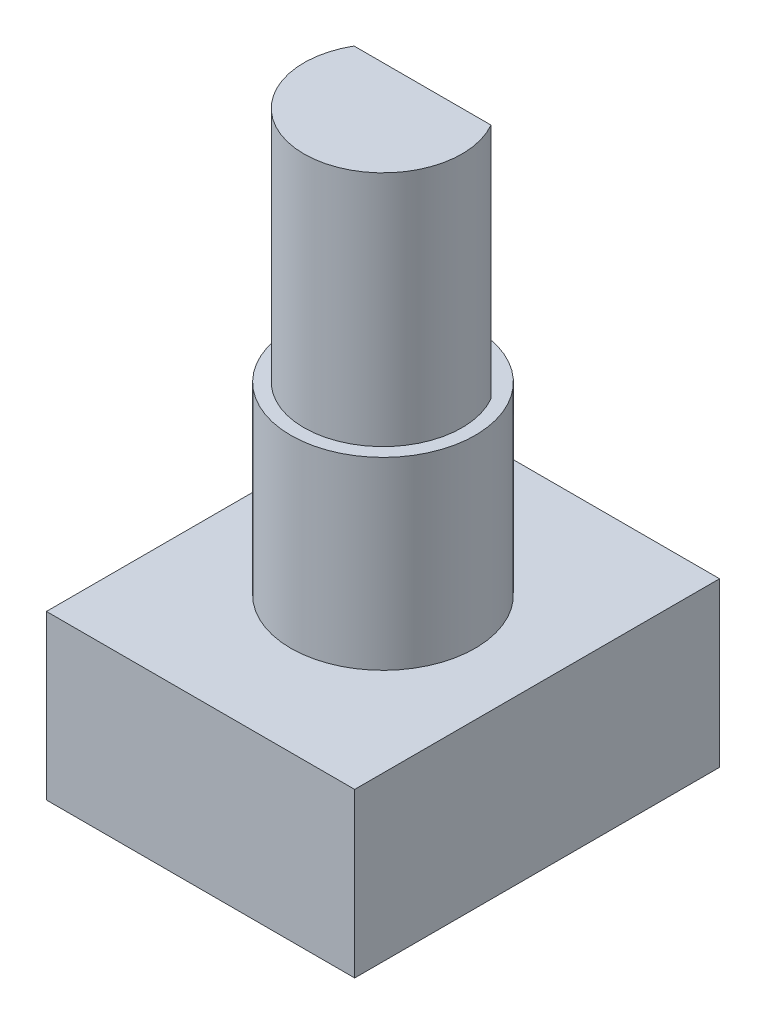
ISO-10303-21;
HEADER;
FILE_DESCRIPTION(('STEP AP214'),'2;1');
FILE_NAME('part.step','',(''),(''),'','','');
FILE_SCHEMA(('AUTOMOTIVE_DESIGN { 1 0 10303 214 1 1 1 1 }'));
ENDSEC;
DATA;
#1=APPLICATION_CONTEXT('core data for automotive mechanical design processes');
#2=APPLICATION_PROTOCOL_DEFINITION('international standard','automotive_design',2000,#1);
#3=PRODUCT_CONTEXT('',#1,'mechanical');
#4=PRODUCT('Part','Part','',(#3));
#5=PRODUCT_RELATED_PRODUCT_CATEGORY('part','',(#4));
#6=PRODUCT_DEFINITION_FORMATION('','',#4);
#7=PRODUCT_DEFINITION_CONTEXT('part definition',#1,'design');
#8=PRODUCT_DEFINITION('design','',#6,#7);
#9=PRODUCT_DEFINITION_SHAPE('','',#8);
#10=(LENGTH_UNIT() NAMED_UNIT(*) SI_UNIT(.MILLI.,.METRE.));
#11=(NAMED_UNIT(*) PLANE_ANGLE_UNIT() SI_UNIT($,.RADIAN.));
#12=(NAMED_UNIT(*) SI_UNIT($,.STERADIAN.) SOLID_ANGLE_UNIT());
#13=UNCERTAINTY_MEASURE_WITH_UNIT(LENGTH_MEASURE(1.E-05),#10,'distance_accuracy_value','');
#14=(GEOMETRIC_REPRESENTATION_CONTEXT(3) GLOBAL_UNCERTAINTY_ASSIGNED_CONTEXT((#13)) GLOBAL_UNIT_ASSIGNED_CONTEXT((#10,
#11,#12)) REPRESENTATION_CONTEXT('',''));
#15=CARTESIAN_POINT('',(0.,0.,0.));
#16=DIRECTION('',(0.,0.,1.));
#17=DIRECTION('',(1.,0.,0.));
#18=AXIS2_PLACEMENT_3D('',#15,#16,#17);
#19=CARTESIAN_POINT('',(0.,6.2,0.));
#20=DIRECTION('',(1.,0.,0.));
#21=DIRECTION('',(0.,0.,-1.));
#22=AXIS2_PLACEMENT_3D('',#19,#20,#21);
#23=PLANE('',#22);
#24=DIRECTION('',(0.,0.,1.));
#25=VECTOR('',#24,1.);
#26=CARTESIAN_POINT('',(0.,0.,0.));
#27=LINE('',#26,#25);
#28=CARTESIAN_POINT('',(0.,0.,-13.85));
#29=VERTEX_POINT('',#28);
#30=CARTESIAN_POINT('',(0.,0.,0.));
#31=VERTEX_POINT('',#30);
#32=EDGE_CURVE('E131',#29,#31,#27,.T.);
#33=ORIENTED_EDGE('',*,*,#32,.T.);
#34=DIRECTION('',(0.,-1.,0.));
#35=VECTOR('',#34,1.);
#36=CARTESIAN_POINT('',(0.,6.2,0.));
#37=LINE('',#36,#35);
#38=CARTESIAN_POINT('',(0.,6.2,0.));
#39=VERTEX_POINT('',#38);
#40=EDGE_CURVE('E46',#39,#31,#37,.T.);
#41=ORIENTED_EDGE('',*,*,#40,.F.);
#42=DIRECTION('',(0.,0.,1.));
#43=VECTOR('',#42,1.);
#44=CARTESIAN_POINT('',(0.,6.2,0.));
#45=LINE('',#44,#43);
#46=CARTESIAN_POINT('',(0.,6.2,-13.85));
#47=VERTEX_POINT('',#46);
#48=EDGE_CURVE('E136',#47,#39,#45,.T.);
#49=ORIENTED_EDGE('',*,*,#48,.F.);
#50=DIRECTION('',(0.,-1.,0.));
#51=VECTOR('',#50,1.);
#52=CARTESIAN_POINT('',(0.,6.2,-13.85));
#53=LINE('',#52,#51);
#54=EDGE_CURVE('E146',#47,#29,#53,.T.);
#55=ORIENTED_EDGE('',*,*,#54,.T.);
#56=EDGE_LOOP('',(#33,#41,#49,#55));
#57=FACE_BOUND('',#56,.T.);
#58=ADVANCED_FACE('F43',(#57),#23,.F.);
#59=CARTESIAN_POINT('',(0.,6.2,0.));
#60=DIRECTION('',(0.,0.,-1.));
#61=DIRECTION('',(-1.,0.,0.));
#62=AXIS2_PLACEMENT_3D('',#59,#60,#61);
#63=PLANE('',#62);
#64=DIRECTION('',(1.,0.,0.));
#65=VECTOR('',#64,1.);
#66=CARTESIAN_POINT('',(0.,0.,0.));
#67=LINE('',#66,#65);
#68=CARTESIAN_POINT('',(11.7,0.,0.));
#69=VERTEX_POINT('',#68);
#70=EDGE_CURVE('E150',#31,#69,#67,.T.);
#71=ORIENTED_EDGE('',*,*,#70,.T.);
#72=DIRECTION('',(0.,-1.,0.));
#73=VECTOR('',#72,1.);
#74=CARTESIAN_POINT('',(11.7,6.2,0.));
#75=LINE('',#74,#73);
#76=CARTESIAN_POINT('',(11.7,6.2,0.));
#77=VERTEX_POINT('',#76);
#78=EDGE_CURVE('E162',#77,#69,#75,.T.);
#79=ORIENTED_EDGE('',*,*,#78,.F.);
#80=DIRECTION('',(1.,0.,0.));
#81=VECTOR('',#80,1.);
#82=CARTESIAN_POINT('',(0.,6.2,0.));
#83=LINE('',#82,#81);
#84=EDGE_CURVE('E96',#39,#77,#83,.T.);
#85=ORIENTED_EDGE('',*,*,#84,.F.);
#86=ORIENTED_EDGE('',*,*,#40,.T.);
#87=EDGE_LOOP('',(#71,#79,#85,#86));
#88=FACE_BOUND('',#87,.T.);
#89=ADVANCED_FACE('F170',(#88),#63,.F.);
#90=CARTESIAN_POINT('',(11.7,6.2,0.));
#91=DIRECTION('',(-1.,0.,0.));
#92=DIRECTION('',(0.,0.,1.));
#93=AXIS2_PLACEMENT_3D('',#90,#91,#92);
#94=PLANE('',#93);
#95=DIRECTION('',(0.,0.,-1.));
#96=VECTOR('',#95,1.);
#97=CARTESIAN_POINT('',(11.7,0.,0.));
#98=LINE('',#97,#96);
#99=CARTESIAN_POINT('',(11.7,0.,-13.85));
#100=VERTEX_POINT('',#99);
#101=EDGE_CURVE('E153',#69,#100,#98,.T.);
#102=ORIENTED_EDGE('',*,*,#101,.T.);
#103=DIRECTION('',(0.,-1.,0.));
#104=VECTOR('',#103,1.);
#105=CARTESIAN_POINT('',(11.7,6.2,-13.85));
#106=LINE('',#105,#104);
#107=CARTESIAN_POINT('',(11.7,6.2,-13.85));
#108=VERTEX_POINT('',#107);
#109=EDGE_CURVE('E160',#108,#100,#106,.T.);
#110=ORIENTED_EDGE('',*,*,#109,.F.);
#111=DIRECTION('',(0.,0.,-1.));
#112=VECTOR('',#111,1.);
#113=CARTESIAN_POINT('',(11.7,6.2,0.));
#114=LINE('',#113,#112);
#115=EDGE_CURVE('E141',#77,#108,#114,.T.);
#116=ORIENTED_EDGE('',*,*,#115,.F.);
#117=ORIENTED_EDGE('',*,*,#78,.T.);
#118=EDGE_LOOP('',(#102,#110,#116,#117));
#119=FACE_BOUND('',#118,.T.);
#120=ADVANCED_FACE('F177',(#119),#94,.F.);
#121=CARTESIAN_POINT('',(0.,6.2,-13.85));
#122=DIRECTION('',(0.,0.,1.));
#123=DIRECTION('',(1.,0.,0.));
#124=AXIS2_PLACEMENT_3D('',#121,#122,#123);
#125=PLANE('',#124);
#126=DIRECTION('',(-1.,0.,0.));
#127=VECTOR('',#126,1.);
#128=CARTESIAN_POINT('',(0.,0.,-13.85));
#129=LINE('',#128,#127);
#130=EDGE_CURVE('E88',#100,#29,#129,.T.);
#131=ORIENTED_EDGE('',*,*,#130,.T.);
#132=ORIENTED_EDGE('',*,*,#54,.F.);
#133=DIRECTION('',(-1.,0.,0.));
#134=VECTOR('',#133,1.);
#135=CARTESIAN_POINT('',(0.,6.2,-13.85));
#136=LINE('',#135,#134);
#137=EDGE_CURVE('E67',#108,#47,#136,.T.);
#138=ORIENTED_EDGE('',*,*,#137,.F.);
#139=ORIENTED_EDGE('',*,*,#109,.T.);
#140=EDGE_LOOP('',(#131,#132,#138,#139));
#141=FACE_BOUND('',#140,.T.);
#142=ADVANCED_FACE('F178',(#141),#125,.F.);
#143=CARTESIAN_POINT('',(0.,6.2,0.));
#144=DIRECTION('',(0.,-1.,0.));
#145=DIRECTION('',(0.,0.,-1.));
#146=AXIS2_PLACEMENT_3D('',#143,#144,#145);
#147=PLANE('',#146);
#148=CARTESIAN_POINT('',(5.85,6.2,-6.925));
#149=DIRECTION('',(0.,1.,0.));
#150=DIRECTION('',(0.,0.,1.));
#151=AXIS2_PLACEMENT_3D('',#148,#149,#150);
#152=CIRCLE('',#151,3.5);
#153=CARTESIAN_POINT('',(5.85,6.2,-3.425));
#154=VERTEX_POINT('',#153);
#155=EDGE_CURVE('E11',#154,#154,#152,.T.);
#156=ORIENTED_EDGE('',*,*,#155,.F.);
#157=EDGE_LOOP('',(#156));
#158=FACE_BOUND('',#157,.T.);
#159=ORIENTED_EDGE('',*,*,#48,.T.);
#160=ORIENTED_EDGE('',*,*,#84,.T.);
#161=ORIENTED_EDGE('',*,*,#115,.T.);
#162=ORIENTED_EDGE('',*,*,#137,.T.);
#163=EDGE_LOOP('',(#159,#160,#161,#162));
#164=FACE_BOUND('',#163,.T.);
#165=ADVANCED_FACE('F179',(#158,#164),#147,.F.);
#166=CARTESIAN_POINT('',(0.,0.,0.));
#167=DIRECTION('',(0.,-1.,0.));
#168=DIRECTION('',(0.,0.,-1.));
#169=AXIS2_PLACEMENT_3D('',#166,#167,#168);
#170=PLANE('',#169);
#171=ORIENTED_EDGE('',*,*,#32,.F.);
#172=ORIENTED_EDGE('',*,*,#130,.F.);
#173=ORIENTED_EDGE('',*,*,#101,.F.);
#174=ORIENTED_EDGE('',*,*,#70,.F.);
#175=EDGE_LOOP('',(#171,#172,#173,#174));
#176=FACE_BOUND('',#175,.T.);
#177=ADVANCED_FACE('F175',(#176),#170,.T.);
#178=CARTESIAN_POINT('',(5.85,13.2,-6.925));
#179=DIRECTION('',(0.,-1.,0.));
#180=DIRECTION('',(0.,0.,-1.));
#181=AXIS2_PLACEMENT_3D('',#178,#179,#180);
#182=CYLINDRICAL_SURFACE('',#181,3.5);
#183=CARTESIAN_POINT('',(5.85,13.2,-6.925));
#184=DIRECTION('',(0.,1.,0.));
#185=DIRECTION('',(0.,0.,1.));
#186=AXIS2_PLACEMENT_3D('',#183,#184,#185);
#187=CIRCLE('',#186,3.5);
#188=CARTESIAN_POINT('',(5.85,13.2,-3.425));
#189=VERTEX_POINT('',#188);
#190=EDGE_CURVE('E126',#189,#189,#187,.T.);
#191=ORIENTED_EDGE('',*,*,#190,.F.);
#192=EDGE_LOOP('',(#191));
#193=FACE_BOUND('',#192,.T.);
#194=ORIENTED_EDGE('',*,*,#155,.T.);
#195=EDGE_LOOP('',(#194));
#196=FACE_BOUND('',#195,.T.);
#197=ADVANCED_FACE('F187',(#193,#196),#182,.T.);
#198=CARTESIAN_POINT('',(5.85,13.2,-6.925));
#199=DIRECTION('',(0.,1.,0.));
#200=DIRECTION('',(0.,0.,1.));
#201=AXIS2_PLACEMENT_3D('',#198,#199,#200);
#202=PLANE('',#201);
#203=CARTESIAN_POINT('',(5.85,13.2,-6.925));
#204=DIRECTION('',(0.,1.,0.));
#205=DIRECTION('',(0.,0.,1.));
#206=AXIS2_PLACEMENT_3D('',#203,#204,#205);
#207=CIRCLE('',#206,3.);
#208=CARTESIAN_POINT('',(3.25192378864668,13.2,-8.425));
#209=VERTEX_POINT('',#208);
#210=CARTESIAN_POINT('',(8.44807621135332,13.2,-8.425));
#211=VERTEX_POINT('',#210);
#212=EDGE_CURVE('E124',#209,#211,#207,.T.);
#213=ORIENTED_EDGE('',*,*,#212,.F.);
#214=DIRECTION('',(-1.,0.,0.));
#215=VECTOR('',#214,1.);
#216=CARTESIAN_POINT('',(3.25192378864668,13.2,-8.425));
#217=LINE('',#216,#215);
#218=EDGE_CURVE('E58',#211,#209,#217,.T.);
#219=ORIENTED_EDGE('',*,*,#218,.F.);
#220=EDGE_LOOP('',(#213,#219));
#221=FACE_BOUND('',#220,.T.);
#222=ORIENTED_EDGE('',*,*,#190,.T.);
#223=EDGE_LOOP('',(#222));
#224=FACE_BOUND('',#223,.T.);
#225=ADVANCED_FACE('F228',(#221,#224),#202,.T.);
#226=CARTESIAN_POINT('',(5.85,22.2,-6.925));
#227=DIRECTION('',(0.,-1.,0.));
#228=DIRECTION('',(0.,0.,-1.));
#229=AXIS2_PLACEMENT_3D('',#226,#227,#228);
#230=CYLINDRICAL_SURFACE('',#229,3.);
#231=ORIENTED_EDGE('',*,*,#212,.T.);
#232=DIRECTION('',(0.,-1.,0.));
#233=VECTOR('',#232,1.);
#234=CARTESIAN_POINT('',(8.44807621135332,22.2,-8.425));
#235=LINE('',#234,#233);
#236=CARTESIAN_POINT('',(8.44807621135332,22.2,-8.425));
#237=VERTEX_POINT('',#236);
#238=EDGE_CURVE('E110',#237,#211,#235,.T.);
#239=ORIENTED_EDGE('',*,*,#238,.F.);
#240=CARTESIAN_POINT('',(5.85,22.2,-6.925));
#241=DIRECTION('',(0.,1.,0.));
#242=DIRECTION('',(0.,0.,1.));
#243=AXIS2_PLACEMENT_3D('',#240,#241,#242);
#244=CIRCLE('',#243,3.);
#245=CARTESIAN_POINT('',(3.25192378864668,22.2,-8.425));
#246=VERTEX_POINT('',#245);
#247=EDGE_CURVE('E117',#246,#237,#244,.T.);
#248=ORIENTED_EDGE('',*,*,#247,.F.);
#249=DIRECTION('',(0.,-1.,0.));
#250=VECTOR('',#249,1.);
#251=CARTESIAN_POINT('',(3.25192378864668,22.2,-8.425));
#252=LINE('',#251,#250);
#253=EDGE_CURVE('E113',#246,#209,#252,.T.);
#254=ORIENTED_EDGE('',*,*,#253,.T.);
#255=EDGE_LOOP('',(#231,#239,#248,#254));
#256=FACE_BOUND('',#255,.T.);
#257=ADVANCED_FACE('F123',(#256),#230,.T.);
#258=CARTESIAN_POINT('',(3.25192378864668,22.2,-8.425));
#259=DIRECTION('',(0.,0.,1.));
#260=DIRECTION('',(1.,0.,0.));
#261=AXIS2_PLACEMENT_3D('',#258,#259,#260);
#262=PLANE('',#261);
#263=ORIENTED_EDGE('',*,*,#218,.T.);
#264=ORIENTED_EDGE('',*,*,#253,.F.);
#265=DIRECTION('',(-1.,0.,0.));
#266=VECTOR('',#265,1.);
#267=CARTESIAN_POINT('',(3.25192378864668,22.2,-8.425));
#268=LINE('',#267,#266);
#269=EDGE_CURVE('E106',#237,#246,#268,.T.);
#270=ORIENTED_EDGE('',*,*,#269,.F.);
#271=ORIENTED_EDGE('',*,*,#238,.T.);
#272=EDGE_LOOP('',(#263,#264,#270,#271));
#273=FACE_BOUND('',#272,.T.);
#274=ADVANCED_FACE('F108',(#273),#262,.F.);
#275=CARTESIAN_POINT('',(5.85,22.2,-6.925));
#276=DIRECTION('',(0.,1.,0.));
#277=DIRECTION('',(0.,0.,1.));
#278=AXIS2_PLACEMENT_3D('',#275,#276,#277);
#279=PLANE('',#278);
#280=ORIENTED_EDGE('',*,*,#247,.T.);
#281=ORIENTED_EDGE('',*,*,#269,.T.);
#282=EDGE_LOOP('',(#280,#281));
#283=FACE_BOUND('',#282,.T.);
#284=ADVANCED_FACE('F119',(#283),#279,.T.);
#285=CLOSED_SHELL('',(#58,#89,#120,#142,#165,#177,#197,#225,#257,#274,#284));
#286=MANIFOLD_SOLID_BREP('B2',#285);
#287=ADVANCED_BREP_SHAPE_REPRESENTATION('',(#18,#286),#14);
#288=SHAPE_DEFINITION_REPRESENTATION(#9,#287);
ENDSEC;
END-ISO-10303-21;
